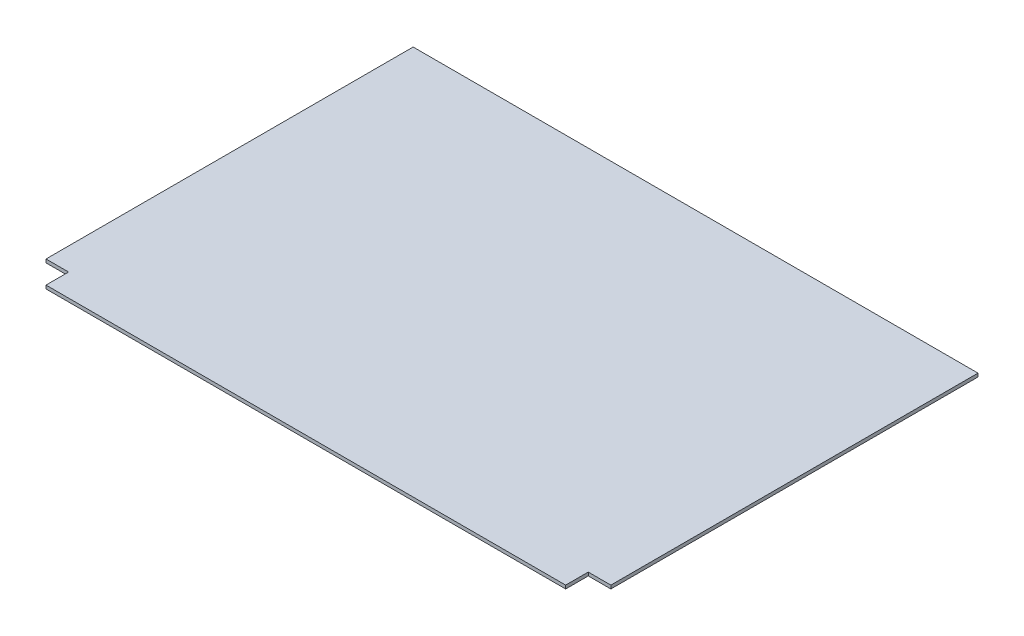
ISO-10303-21;
HEADER;
FILE_DESCRIPTION(('STEP AP214'),'2;1');
FILE_NAME('part.step','',(''),(''),'','','');
FILE_SCHEMA(('AUTOMOTIVE_DESIGN { 1 0 10303 214 1 1 1 1 }'));
ENDSEC;
DATA;
#1=APPLICATION_CONTEXT('core data for automotive mechanical design processes');
#2=APPLICATION_PROTOCOL_DEFINITION('international standard','automotive_design',2000,#1);
#3=PRODUCT_CONTEXT('',#1,'mechanical');
#4=PRODUCT('Part','Part','',(#3));
#5=PRODUCT_RELATED_PRODUCT_CATEGORY('part','',(#4));
#6=PRODUCT_DEFINITION_FORMATION('','',#4);
#7=PRODUCT_DEFINITION_CONTEXT('part definition',#1,'design');
#8=PRODUCT_DEFINITION('design','',#6,#7);
#9=PRODUCT_DEFINITION_SHAPE('','',#8);
#10=(LENGTH_UNIT() NAMED_UNIT(*) SI_UNIT(.MILLI.,.METRE.));
#11=(NAMED_UNIT(*) PLANE_ANGLE_UNIT() SI_UNIT($,.RADIAN.));
#12=(NAMED_UNIT(*) SI_UNIT($,.STERADIAN.) SOLID_ANGLE_UNIT());
#13=UNCERTAINTY_MEASURE_WITH_UNIT(LENGTH_MEASURE(1.E-05),#10,'distance_accuracy_value','');
#14=(GEOMETRIC_REPRESENTATION_CONTEXT(3) GLOBAL_UNCERTAINTY_ASSIGNED_CONTEXT((#13)) GLOBAL_UNIT_ASSIGNED_CONTEXT((#10,
#11,#12)) REPRESENTATION_CONTEXT('',''));
#15=CARTESIAN_POINT('',(0.,0.,0.));
#16=DIRECTION('',(0.,0.,1.));
#17=DIRECTION('',(1.,0.,0.));
#18=AXIS2_PLACEMENT_3D('',#15,#16,#17);
#19=CARTESIAN_POINT('',(-250.,3.,-170.));
#20=DIRECTION('',(1.,0.,0.));
#21=DIRECTION('',(0.,0.,-1.));
#22=AXIS2_PLACEMENT_3D('',#19,#20,#21);
#23=PLANE('',#22);
#24=DIRECTION('',(0.,0.,1.));
#25=VECTOR('',#24,1.);
#26=CARTESIAN_POINT('',(-250.,0.,-170.));
#27=LINE('',#26,#25);
#28=CARTESIAN_POINT('',(-250.,0.,-170.));
#29=VERTEX_POINT('',#28);
#30=CARTESIAN_POINT('',(-250.,0.,155.));
#31=VERTEX_POINT('',#30);
#32=EDGE_CURVE('E129',#29,#31,#27,.T.);
#33=ORIENTED_EDGE('',*,*,#32,.T.);
#34=DIRECTION('',(0.,-1.,0.));
#35=VECTOR('',#34,1.);
#36=CARTESIAN_POINT('',(-250.,3.,155.));
#37=LINE('',#36,#35);
#38=CARTESIAN_POINT('',(-250.,3.,155.));
#39=VERTEX_POINT('',#38);
#40=EDGE_CURVE('E11',#39,#31,#37,.T.);
#41=ORIENTED_EDGE('',*,*,#40,.F.);
#42=DIRECTION('',(0.,0.,1.));
#43=VECTOR('',#42,1.);
#44=CARTESIAN_POINT('',(-250.,3.,-170.));
#45=LINE('',#44,#43);
#46=CARTESIAN_POINT('',(-250.,3.,-170.));
#47=VERTEX_POINT('',#46);
#48=EDGE_CURVE('E143',#47,#39,#45,.T.);
#49=ORIENTED_EDGE('',*,*,#48,.F.);
#50=DIRECTION('',(0.,-1.,0.));
#51=VECTOR('',#50,1.);
#52=CARTESIAN_POINT('',(-250.,3.,-170.));
#53=LINE('',#52,#51);
#54=EDGE_CURVE('E125',#47,#29,#53,.T.);
#55=ORIENTED_EDGE('',*,*,#54,.T.);
#56=EDGE_LOOP('',(#33,#41,#49,#55));
#57=FACE_BOUND('',#56,.T.);
#58=ADVANCED_FACE('F33',(#57),#23,.F.);
#59=CARTESIAN_POINT('',(-230.,3.,155.));
#60=DIRECTION('',(0.,0.,-1.));
#61=DIRECTION('',(-1.,0.,0.));
#62=AXIS2_PLACEMENT_3D('',#59,#60,#61);
#63=PLANE('',#62);
#64=DIRECTION('',(1.,0.,0.));
#65=VECTOR('',#64,1.);
#66=CARTESIAN_POINT('',(-230.,0.,155.));
#67=LINE('',#66,#65);
#68=CARTESIAN_POINT('',(-230.,0.,155.));
#69=VERTEX_POINT('',#68);
#70=EDGE_CURVE('E132',#31,#69,#67,.T.);
#71=ORIENTED_EDGE('',*,*,#70,.T.);
#72=DIRECTION('',(0.,-1.,0.));
#73=VECTOR('',#72,1.);
#74=CARTESIAN_POINT('',(-230.,3.,155.));
#75=LINE('',#74,#73);
#76=CARTESIAN_POINT('',(-230.,3.,155.));
#77=VERTEX_POINT('',#76);
#78=EDGE_CURVE('E41',#77,#69,#75,.T.);
#79=ORIENTED_EDGE('',*,*,#78,.F.);
#80=DIRECTION('',(1.,0.,0.));
#81=VECTOR('',#80,1.);
#82=CARTESIAN_POINT('',(-230.,3.,155.));
#83=LINE('',#82,#81);
#84=EDGE_CURVE('E92',#39,#77,#83,.T.);
#85=ORIENTED_EDGE('',*,*,#84,.F.);
#86=ORIENTED_EDGE('',*,*,#40,.T.);
#87=EDGE_LOOP('',(#71,#79,#85,#86));
#88=FACE_BOUND('',#87,.T.);
#89=ADVANCED_FACE('F178',(#88),#63,.F.);
#90=CARTESIAN_POINT('',(-230.,3.,175.));
#91=DIRECTION('',(1.,0.,0.));
#92=DIRECTION('',(0.,0.,-1.));
#93=AXIS2_PLACEMENT_3D('',#90,#91,#92);
#94=PLANE('',#93);
#95=DIRECTION('',(0.,0.,1.));
#96=VECTOR('',#95,1.);
#97=CARTESIAN_POINT('',(-230.,0.,175.));
#98=LINE('',#97,#96);
#99=CARTESIAN_POINT('',(-230.,0.,175.));
#100=VERTEX_POINT('',#99);
#101=EDGE_CURVE('E134',#69,#100,#98,.T.);
#102=ORIENTED_EDGE('',*,*,#101,.T.);
#103=DIRECTION('',(0.,-1.,0.));
#104=VECTOR('',#103,1.);
#105=CARTESIAN_POINT('',(-230.,3.,175.));
#106=LINE('',#105,#104);
#107=CARTESIAN_POINT('',(-230.,3.,175.));
#108=VERTEX_POINT('',#107);
#109=EDGE_CURVE('E150',#108,#100,#106,.T.);
#110=ORIENTED_EDGE('',*,*,#109,.F.);
#111=DIRECTION('',(0.,0.,1.));
#112=VECTOR('',#111,1.);
#113=CARTESIAN_POINT('',(-230.,3.,175.));
#114=LINE('',#113,#112);
#115=EDGE_CURVE('E158',#77,#108,#114,.T.);
#116=ORIENTED_EDGE('',*,*,#115,.F.);
#117=ORIENTED_EDGE('',*,*,#78,.T.);
#118=EDGE_LOOP('',(#102,#110,#116,#117));
#119=FACE_BOUND('',#118,.T.);
#120=ADVANCED_FACE('F156',(#119),#94,.F.);
#121=CARTESIAN_POINT('',(230.,3.,175.));
#122=DIRECTION('',(0.,0.,-1.));
#123=DIRECTION('',(-1.,0.,0.));
#124=AXIS2_PLACEMENT_3D('',#121,#122,#123);
#125=PLANE('',#124);
#126=DIRECTION('',(1.,0.,0.));
#127=VECTOR('',#126,1.);
#128=CARTESIAN_POINT('',(230.,0.,175.));
#129=LINE('',#128,#127);
#130=CARTESIAN_POINT('',(230.,0.,175.));
#131=VERTEX_POINT('',#130);
#132=EDGE_CURVE('E136',#100,#131,#129,.T.);
#133=ORIENTED_EDGE('',*,*,#132,.T.);
#134=DIRECTION('',(0.,-1.,0.));
#135=VECTOR('',#134,1.);
#136=CARTESIAN_POINT('',(230.,3.,175.));
#137=LINE('',#136,#135);
#138=CARTESIAN_POINT('',(230.,3.,175.));
#139=VERTEX_POINT('',#138);
#140=EDGE_CURVE('E147',#139,#131,#137,.T.);
#141=ORIENTED_EDGE('',*,*,#140,.F.);
#142=DIRECTION('',(1.,0.,0.));
#143=VECTOR('',#142,1.);
#144=CARTESIAN_POINT('',(230.,3.,175.));
#145=LINE('',#144,#143);
#146=EDGE_CURVE('E170',#108,#139,#145,.T.);
#147=ORIENTED_EDGE('',*,*,#146,.F.);
#148=ORIENTED_EDGE('',*,*,#109,.T.);
#149=EDGE_LOOP('',(#133,#141,#147,#148));
#150=FACE_BOUND('',#149,.T.);
#151=ADVANCED_FACE('F166',(#150),#125,.F.);
#152=CARTESIAN_POINT('',(230.,3.,155.));
#153=DIRECTION('',(-1.,0.,0.));
#154=DIRECTION('',(0.,0.,1.));
#155=AXIS2_PLACEMENT_3D('',#152,#153,#154);
#156=PLANE('',#155);
#157=DIRECTION('',(0.,0.,-1.));
#158=VECTOR('',#157,1.);
#159=CARTESIAN_POINT('',(230.,0.,155.));
#160=LINE('',#159,#158);
#161=CARTESIAN_POINT('',(230.,0.,155.));
#162=VERTEX_POINT('',#161);
#163=EDGE_CURVE('E138',#131,#162,#160,.T.);
#164=ORIENTED_EDGE('',*,*,#163,.T.);
#165=DIRECTION('',(0.,-1.,0.));
#166=VECTOR('',#165,1.);
#167=CARTESIAN_POINT('',(230.,3.,155.));
#168=LINE('',#167,#166);
#169=CARTESIAN_POINT('',(230.,3.,155.));
#170=VERTEX_POINT('',#169);
#171=EDGE_CURVE('E120',#170,#162,#168,.T.);
#172=ORIENTED_EDGE('',*,*,#171,.F.);
#173=DIRECTION('',(0.,0.,-1.));
#174=VECTOR('',#173,1.);
#175=CARTESIAN_POINT('',(230.,3.,155.));
#176=LINE('',#175,#174);
#177=EDGE_CURVE('E111',#139,#170,#176,.T.);
#178=ORIENTED_EDGE('',*,*,#177,.F.);
#179=ORIENTED_EDGE('',*,*,#140,.T.);
#180=EDGE_LOOP('',(#164,#172,#178,#179));
#181=FACE_BOUND('',#180,.T.);
#182=ADVANCED_FACE('F169',(#181),#156,.F.);
#183=CARTESIAN_POINT('',(250.,3.,155.));
#184=DIRECTION('',(0.,0.,-1.));
#185=DIRECTION('',(-1.,0.,0.));
#186=AXIS2_PLACEMENT_3D('',#183,#184,#185);
#187=PLANE('',#186);
#188=DIRECTION('',(1.,0.,0.));
#189=VECTOR('',#188,1.);
#190=CARTESIAN_POINT('',(250.,0.,155.));
#191=LINE('',#190,#189);
#192=CARTESIAN_POINT('',(250.,0.,155.));
#193=VERTEX_POINT('',#192);
#194=EDGE_CURVE('E119',#162,#193,#191,.T.);
#195=ORIENTED_EDGE('',*,*,#194,.T.);
#196=DIRECTION('',(0.,-1.,0.));
#197=VECTOR('',#196,1.);
#198=CARTESIAN_POINT('',(250.,3.,155.));
#199=LINE('',#198,#197);
#200=CARTESIAN_POINT('',(250.,3.,155.));
#201=VERTEX_POINT('',#200);
#202=EDGE_CURVE('E116',#201,#193,#199,.T.);
#203=ORIENTED_EDGE('',*,*,#202,.F.);
#204=DIRECTION('',(1.,0.,0.));
#205=VECTOR('',#204,1.);
#206=CARTESIAN_POINT('',(250.,3.,155.));
#207=LINE('',#206,#205);
#208=EDGE_CURVE('E105',#170,#201,#207,.T.);
#209=ORIENTED_EDGE('',*,*,#208,.F.);
#210=ORIENTED_EDGE('',*,*,#171,.T.);
#211=EDGE_LOOP('',(#195,#203,#209,#210));
#212=FACE_BOUND('',#211,.T.);
#213=ADVANCED_FACE('F117',(#212),#187,.F.);
#214=CARTESIAN_POINT('',(250.,3.,-170.));
#215=DIRECTION('',(-1.,0.,0.));
#216=DIRECTION('',(0.,0.,1.));
#217=AXIS2_PLACEMENT_3D('',#214,#215,#216);
#218=PLANE('',#217);
#219=DIRECTION('',(0.,0.,-1.));
#220=VECTOR('',#219,1.);
#221=CARTESIAN_POINT('',(250.,0.,-170.));
#222=LINE('',#221,#220);
#223=CARTESIAN_POINT('',(250.,0.,-170.));
#224=VERTEX_POINT('',#223);
#225=EDGE_CURVE('E78',#193,#224,#222,.T.);
#226=ORIENTED_EDGE('',*,*,#225,.T.);
#227=DIRECTION('',(0.,-1.,0.));
#228=VECTOR('',#227,1.);
#229=CARTESIAN_POINT('',(250.,3.,-170.));
#230=LINE('',#229,#228);
#231=CARTESIAN_POINT('',(250.,3.,-170.));
#232=VERTEX_POINT('',#231);
#233=EDGE_CURVE('E121',#232,#224,#230,.T.);
#234=ORIENTED_EDGE('',*,*,#233,.F.);
#235=DIRECTION('',(0.,0.,-1.));
#236=VECTOR('',#235,1.);
#237=CARTESIAN_POINT('',(250.,3.,-170.));
#238=LINE('',#237,#236);
#239=EDGE_CURVE('E109',#201,#232,#238,.T.);
#240=ORIENTED_EDGE('',*,*,#239,.F.);
#241=ORIENTED_EDGE('',*,*,#202,.T.);
#242=EDGE_LOOP('',(#226,#234,#240,#241));
#243=FACE_BOUND('',#242,.T.);
#244=ADVANCED_FACE('F123',(#243),#218,.F.);
#245=CARTESIAN_POINT('',(250.,3.,-170.));
#246=DIRECTION('',(0.,0.,1.));
#247=DIRECTION('',(1.,0.,0.));
#248=AXIS2_PLACEMENT_3D('',#245,#246,#247);
#249=PLANE('',#248);
#250=DIRECTION('',(-1.,0.,0.));
#251=VECTOR('',#250,1.);
#252=CARTESIAN_POINT('',(250.,0.,-170.));
#253=LINE('',#252,#251);
#254=EDGE_CURVE('E84',#224,#29,#253,.T.);
#255=ORIENTED_EDGE('',*,*,#254,.T.);
#256=ORIENTED_EDGE('',*,*,#54,.F.);
#257=DIRECTION('',(-1.,0.,0.));
#258=VECTOR('',#257,1.);
#259=CARTESIAN_POINT('',(250.,3.,-170.));
#260=LINE('',#259,#258);
#261=EDGE_CURVE('E49',#232,#47,#260,.T.);
#262=ORIENTED_EDGE('',*,*,#261,.F.);
#263=ORIENTED_EDGE('',*,*,#233,.T.);
#264=EDGE_LOOP('',(#255,#256,#262,#263));
#265=FACE_BOUND('',#264,.T.);
#266=ADVANCED_FACE('F194',(#265),#249,.F.);
#267=CARTESIAN_POINT('',(0.,3.,0.));
#268=DIRECTION('',(0.,-1.,0.));
#269=DIRECTION('',(0.,0.,-1.));
#270=AXIS2_PLACEMENT_3D('',#267,#268,#269);
#271=PLANE('',#270);
#272=ORIENTED_EDGE('',*,*,#48,.T.);
#273=ORIENTED_EDGE('',*,*,#84,.T.);
#274=ORIENTED_EDGE('',*,*,#115,.T.);
#275=ORIENTED_EDGE('',*,*,#146,.T.);
#276=ORIENTED_EDGE('',*,*,#177,.T.);
#277=ORIENTED_EDGE('',*,*,#208,.T.);
#278=ORIENTED_EDGE('',*,*,#239,.T.);
#279=ORIENTED_EDGE('',*,*,#261,.T.);
#280=EDGE_LOOP('',(#272,#273,#274,#275,#276,#277,#278,#279));
#281=FACE_BOUND('',#280,.T.);
#282=ADVANCED_FACE('F107',(#281),#271,.F.);
#283=CARTESIAN_POINT('',(0.,0.,0.));
#284=DIRECTION('',(0.,-1.,0.));
#285=DIRECTION('',(0.,0.,-1.));
#286=AXIS2_PLACEMENT_3D('',#283,#284,#285);
#287=PLANE('',#286);
#288=ORIENTED_EDGE('',*,*,#32,.F.);
#289=ORIENTED_EDGE('',*,*,#254,.F.);
#290=ORIENTED_EDGE('',*,*,#225,.F.);
#291=ORIENTED_EDGE('',*,*,#194,.F.);
#292=ORIENTED_EDGE('',*,*,#163,.F.);
#293=ORIENTED_EDGE('',*,*,#132,.F.);
#294=ORIENTED_EDGE('',*,*,#101,.F.);
#295=ORIENTED_EDGE('',*,*,#70,.F.);
#296=EDGE_LOOP('',(#288,#289,#290,#291,#292,#293,#294,#295));
#297=FACE_BOUND('',#296,.T.);
#298=ADVANCED_FACE('F162',(#297),#287,.T.);
#299=CLOSED_SHELL('',(#58,#89,#120,#151,#182,#213,#244,#266,#282,#298));
#300=MANIFOLD_SOLID_BREP('B2',#299);
#301=ADVANCED_BREP_SHAPE_REPRESENTATION('',(#18,#300),#14);
#302=SHAPE_DEFINITION_REPRESENTATION(#9,#301);
ENDSEC;
END-ISO-10303-21;
